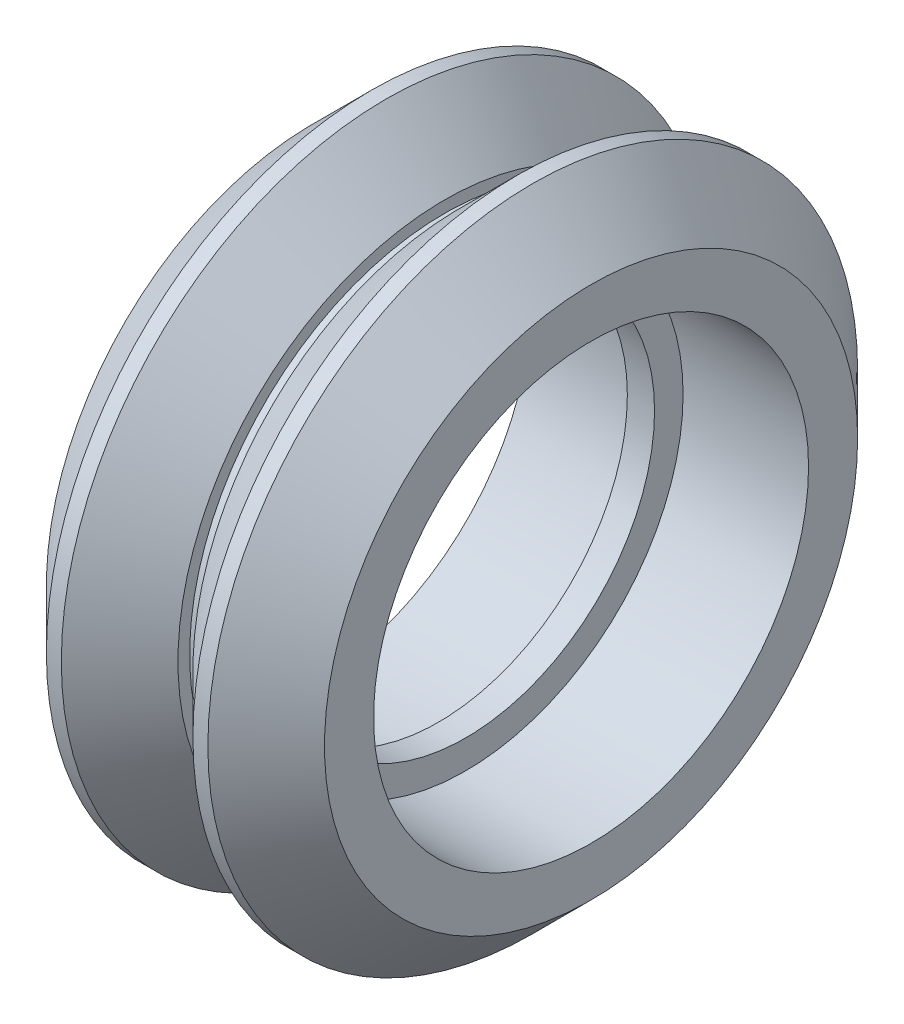
ISO-10303-21;
HEADER;
FILE_DESCRIPTION(('STEP AP214'),'2;1');
FILE_NAME('part.step','',(''),(''),'','','');
FILE_SCHEMA(('AUTOMOTIVE_DESIGN { 1 0 10303 214 1 1 1 1 }'));
ENDSEC;
DATA;
#1=APPLICATION_CONTEXT('core data for automotive mechanical design processes');
#2=APPLICATION_PROTOCOL_DEFINITION('international standard','automotive_design',2000,#1);
#3=PRODUCT_CONTEXT('',#1,'mechanical');
#4=PRODUCT('Part','Part','',(#3));
#5=PRODUCT_RELATED_PRODUCT_CATEGORY('part','',(#4));
#6=PRODUCT_DEFINITION_FORMATION('','',#4);
#7=PRODUCT_DEFINITION_CONTEXT('part definition',#1,'design');
#8=PRODUCT_DEFINITION('design','',#6,#7);
#9=PRODUCT_DEFINITION_SHAPE('','',#8);
#10=(LENGTH_UNIT() NAMED_UNIT(*) SI_UNIT(.MILLI.,.METRE.));
#11=(NAMED_UNIT(*) PLANE_ANGLE_UNIT() SI_UNIT($,.RADIAN.));
#12=(NAMED_UNIT(*) SI_UNIT($,.STERADIAN.) SOLID_ANGLE_UNIT());
#13=UNCERTAINTY_MEASURE_WITH_UNIT(LENGTH_MEASURE(1.E-05),#10,'distance_accuracy_value','');
#14=(GEOMETRIC_REPRESENTATION_CONTEXT(3) GLOBAL_UNCERTAINTY_ASSIGNED_CONTEXT((#13)) GLOBAL_UNIT_ASSIGNED_CONTEXT((#10,
#11,#12)) REPRESENTATION_CONTEXT('',''));
#15=CARTESIAN_POINT('',(0.,0.,0.));
#16=DIRECTION('',(0.,0.,1.));
#17=DIRECTION('',(1.,0.,0.));
#18=AXIS2_PLACEMENT_3D('',#15,#16,#17);
#19=CARTESIAN_POINT('',(-0.499999999999999,6.95,0.));
#20=DIRECTION('',(-1.,0.,0.));
#21=DIRECTION('',(0.,0.,1.));
#22=AXIS2_PLACEMENT_3D('',#19,#20,#21);
#23=PLANE('',#22);
#24=CARTESIAN_POINT('',(-0.499999999999999,0.,0.));
#25=DIRECTION('',(1.,0.,0.));
#26=DIRECTION('',(0.,0.,-1.));
#27=AXIS2_PLACEMENT_3D('',#24,#25,#26);
#28=CIRCLE('',#27,6.95);
#29=CARTESIAN_POINT('',(-0.499999999999999,0.,-6.95));
#30=VERTEX_POINT('',#29);
#31=EDGE_CURVE('E10',#30,#30,#28,.T.);
#32=ORIENTED_EDGE('',*,*,#31,.T.);
#33=EDGE_LOOP('',(#32));
#34=FACE_BOUND('',#33,.T.);
#35=CARTESIAN_POINT('',(-0.499999999999999,0.,0.));
#36=DIRECTION('',(1.,0.,0.));
#37=DIRECTION('',(0.,0.,-1.));
#38=AXIS2_PLACEMENT_3D('',#35,#36,#37);
#39=CIRCLE('',#38,8.);
#40=CARTESIAN_POINT('',(-0.499999999999999,0.,-8.));
#41=VERTEX_POINT('',#40);
#42=EDGE_CURVE('E85',#41,#41,#39,.T.);
#43=ORIENTED_EDGE('',*,*,#42,.F.);
#44=EDGE_LOOP('',(#43));
#45=FACE_BOUND('',#44,.T.);
#46=ADVANCED_FACE('F33',(#34,#45),#23,.T.);
#47=CARTESIAN_POINT('',(0.,0.,0.));
#48=DIRECTION('',(1.,0.,0.));
#49=DIRECTION('',(0.,0.,-1.));
#50=AXIS2_PLACEMENT_3D('',#47,#48,#49);
#51=CYLINDRICAL_SURFACE('',#50,6.95);
#52=CARTESIAN_POINT('',(0.500000000000001,0.,0.));
#53=DIRECTION('',(1.,0.,0.));
#54=DIRECTION('',(0.,0.,-1.));
#55=AXIS2_PLACEMENT_3D('',#52,#53,#54);
#56=CIRCLE('',#55,6.95);
#57=CARTESIAN_POINT('',(0.500000000000001,0.,-6.95));
#58=VERTEX_POINT('',#57);
#59=EDGE_CURVE('E39',#58,#58,#56,.T.);
#60=ORIENTED_EDGE('',*,*,#59,.T.);
#61=EDGE_LOOP('',(#60));
#62=FACE_BOUND('',#61,.T.);
#63=ORIENTED_EDGE('',*,*,#31,.F.);
#64=EDGE_LOOP('',(#63));
#65=FACE_BOUND('',#64,.T.);
#66=ADVANCED_FACE('F93',(#62,#65),#51,.F.);
#67=CARTESIAN_POINT('',(0.500000000000001,6.95,0.));
#68=DIRECTION('',(1.,0.,0.));
#69=DIRECTION('',(0.,0.,-1.));
#70=AXIS2_PLACEMENT_3D('',#67,#68,#69);
#71=PLANE('',#70);
#72=CARTESIAN_POINT('',(0.5,0.,0.));
#73=DIRECTION('',(1.,0.,0.));
#74=DIRECTION('',(0.,0.,-1.));
#75=AXIS2_PLACEMENT_3D('',#72,#73,#74);
#76=CIRCLE('',#75,8.);
#77=CARTESIAN_POINT('',(0.5,0.,-8.));
#78=VERTEX_POINT('',#77);
#79=EDGE_CURVE('E43',#78,#78,#76,.T.);
#80=ORIENTED_EDGE('',*,*,#79,.T.);
#81=EDGE_LOOP('',(#80));
#82=FACE_BOUND('',#81,.T.);
#83=ORIENTED_EDGE('',*,*,#59,.F.);
#84=EDGE_LOOP('',(#83));
#85=FACE_BOUND('',#84,.T.);
#86=ADVANCED_FACE('F97',(#82,#85),#71,.T.);
#87=CARTESIAN_POINT('',(0.,0.,0.));
#88=DIRECTION('',(1.,0.,0.));
#89=DIRECTION('',(0.,0.,-1.));
#90=AXIS2_PLACEMENT_3D('',#87,#88,#89);
#91=CYLINDRICAL_SURFACE('',#90,8.);
#92=CARTESIAN_POINT('',(5.115,0.,0.));
#93=DIRECTION('',(1.,0.,0.));
#94=DIRECTION('',(0.,0.,-1.));
#95=AXIS2_PLACEMENT_3D('',#92,#93,#94);
#96=CIRCLE('',#95,8.);
#97=CARTESIAN_POINT('',(5.115,0.,-8.));
#98=VERTEX_POINT('',#97);
#99=EDGE_CURVE('E47',#98,#98,#96,.T.);
#100=ORIENTED_EDGE('',*,*,#99,.T.);
#101=EDGE_LOOP('',(#100));
#102=FACE_BOUND('',#101,.T.);
#103=ORIENTED_EDGE('',*,*,#79,.F.);
#104=EDGE_LOOP('',(#103));
#105=FACE_BOUND('',#104,.T.);
#106=ADVANCED_FACE('F101',(#102,#105),#91,.F.);
#107=CARTESIAN_POINT('',(5.115,8.,0.));
#108=DIRECTION('',(1.,0.,0.));
#109=DIRECTION('',(0.,0.,-1.));
#110=AXIS2_PLACEMENT_3D('',#107,#108,#109);
#111=PLANE('',#110);
#112=CARTESIAN_POINT('',(5.115,0.,0.));
#113=DIRECTION('',(1.,0.,0.));
#114=DIRECTION('',(0.,0.,-1.));
#115=AXIS2_PLACEMENT_3D('',#112,#113,#114);
#116=CIRCLE('',#115,9.805);
#117=CARTESIAN_POINT('',(5.115,0.,-9.805));
#118=VERTEX_POINT('',#117);
#119=EDGE_CURVE('E52',#118,#118,#116,.T.);
#120=ORIENTED_EDGE('',*,*,#119,.T.);
#121=EDGE_LOOP('',(#120));
#122=FACE_BOUND('',#121,.T.);
#123=ORIENTED_EDGE('',*,*,#99,.F.);
#124=EDGE_LOOP('',(#123));
#125=FACE_BOUND('',#124,.T.);
#126=ADVANCED_FACE('F108',(#122,#125),#111,.T.);
#127=CARTESIAN_POINT('',(5.115,0.,0.));
#128=DIRECTION('',(-1.,0.,0.));
#129=DIRECTION('',(0.,0.,1.));
#130=AXIS2_PLACEMENT_3D('',#127,#128,#129);
#131=CONICAL_SURFACE('',#130,9.805,0.785398163397447);
#132=CARTESIAN_POINT('',(2.96999999999999,0.,0.));
#133=DIRECTION('',(1.,0.,0.));
#134=DIRECTION('',(0.,0.,-1.));
#135=AXIS2_PLACEMENT_3D('',#132,#133,#134);
#136=CIRCLE('',#135,11.95);
#137=CARTESIAN_POINT('',(2.96999999999999,0.,-11.95));
#138=VERTEX_POINT('',#137);
#139=EDGE_CURVE('E55',#138,#138,#136,.T.);
#140=ORIENTED_EDGE('',*,*,#139,.T.);
#141=EDGE_LOOP('',(#140));
#142=FACE_BOUND('',#141,.T.);
#143=ORIENTED_EDGE('',*,*,#119,.F.);
#144=EDGE_LOOP('',(#143));
#145=FACE_BOUND('',#144,.T.);
#146=ADVANCED_FACE('F112',(#142,#145),#131,.T.);
#147=CARTESIAN_POINT('',(0.,0.,0.));
#148=DIRECTION('',(1.,0.,0.));
#149=DIRECTION('',(0.,0.,-1.));
#150=AXIS2_PLACEMENT_3D('',#147,#148,#149);
#151=CYLINDRICAL_SURFACE('',#150,11.95);
#152=CARTESIAN_POINT('',(2.41999999999999,0.,0.));
#153=DIRECTION('',(1.,0.,0.));
#154=DIRECTION('',(0.,0.,-1.));
#155=AXIS2_PLACEMENT_3D('',#152,#153,#154);
#156=CIRCLE('',#155,11.95);
#157=CARTESIAN_POINT('',(2.41999999999999,0.,-11.95));
#158=VERTEX_POINT('',#157);
#159=EDGE_CURVE('E58',#158,#158,#156,.T.);
#160=ORIENTED_EDGE('',*,*,#159,.T.);
#161=EDGE_LOOP('',(#160));
#162=FACE_BOUND('',#161,.T.);
#163=ORIENTED_EDGE('',*,*,#139,.F.);
#164=EDGE_LOOP('',(#163));
#165=FACE_BOUND('',#164,.T.);
#166=ADVANCED_FACE('F116',(#162,#165),#151,.T.);
#167=CARTESIAN_POINT('',(2.41999999999999,0.,0.));
#168=DIRECTION('',(1.,0.,0.));
#169=DIRECTION('',(0.,0.,-1.));
#170=AXIS2_PLACEMENT_3D('',#167,#168,#169);
#171=CONICAL_SURFACE('',#170,11.95,0.785398163397449);
#172=CARTESIAN_POINT('',(0.274999999999998,0.,0.));
#173=DIRECTION('',(1.,0.,0.));
#174=DIRECTION('',(0.,0.,-1.));
#175=AXIS2_PLACEMENT_3D('',#172,#173,#174);
#176=CIRCLE('',#175,9.805);
#177=CARTESIAN_POINT('',(0.274999999999998,0.,-9.805));
#178=VERTEX_POINT('',#177);
#179=EDGE_CURVE('E61',#178,#178,#176,.T.);
#180=ORIENTED_EDGE('',*,*,#179,.T.);
#181=EDGE_LOOP('',(#180));
#182=FACE_BOUND('',#181,.T.);
#183=ORIENTED_EDGE('',*,*,#159,.F.);
#184=EDGE_LOOP('',(#183));
#185=FACE_BOUND('',#184,.T.);
#186=ADVANCED_FACE('F120',(#182,#185),#171,.T.);
#187=CARTESIAN_POINT('',(0.275,9.805,0.));
#188=DIRECTION('',(-1.,0.,0.));
#189=DIRECTION('',(0.,0.,1.));
#190=AXIS2_PLACEMENT_3D('',#187,#188,#189);
#191=PLANE('',#190);
#192=CARTESIAN_POINT('',(0.275000000000003,0.,0.));
#193=DIRECTION('',(1.,0.,0.));
#194=DIRECTION('',(0.,0.,-1.));
#195=AXIS2_PLACEMENT_3D('',#192,#193,#194);
#196=CIRCLE('',#195,9.375);
#197=CARTESIAN_POINT('',(0.275000000000003,0.,-9.375));
#198=VERTEX_POINT('',#197);
#199=EDGE_CURVE('E64',#198,#198,#196,.T.);
#200=ORIENTED_EDGE('',*,*,#199,.T.);
#201=EDGE_LOOP('',(#200));
#202=FACE_BOUND('',#201,.T.);
#203=ORIENTED_EDGE('',*,*,#179,.F.);
#204=EDGE_LOOP('',(#203));
#205=FACE_BOUND('',#204,.T.);
#206=ADVANCED_FACE('F124',(#202,#205),#191,.T.);
#207=CARTESIAN_POINT('',(0.,0.,0.));
#208=DIRECTION('',(1.,0.,0.));
#209=DIRECTION('',(0.,0.,-1.));
#210=AXIS2_PLACEMENT_3D('',#207,#208,#209);
#211=CYLINDRICAL_SURFACE('',#210,9.375);
#212=CARTESIAN_POINT('',(-0.274999999999998,0.,0.));
#213=DIRECTION('',(1.,0.,0.));
#214=DIRECTION('',(0.,0.,-1.));
#215=AXIS2_PLACEMENT_3D('',#212,#213,#214);
#216=CIRCLE('',#215,9.375);
#217=CARTESIAN_POINT('',(-0.274999999999998,0.,-9.375));
#218=VERTEX_POINT('',#217);
#219=EDGE_CURVE('E67',#218,#218,#216,.T.);
#220=ORIENTED_EDGE('',*,*,#219,.T.);
#221=EDGE_LOOP('',(#220));
#222=FACE_BOUND('',#221,.T.);
#223=ORIENTED_EDGE('',*,*,#199,.F.);
#224=EDGE_LOOP('',(#223));
#225=FACE_BOUND('',#224,.T.);
#226=ADVANCED_FACE('F128',(#222,#225),#211,.T.);
#227=CARTESIAN_POINT('',(-0.274999999999998,9.805,0.));
#228=DIRECTION('',(1.,0.,0.));
#229=DIRECTION('',(0.,0.,-1.));
#230=AXIS2_PLACEMENT_3D('',#227,#228,#229);
#231=PLANE('',#230);
#232=CARTESIAN_POINT('',(-0.274999999999998,0.,0.));
#233=DIRECTION('',(1.,0.,0.));
#234=DIRECTION('',(0.,0.,-1.));
#235=AXIS2_PLACEMENT_3D('',#232,#233,#234);
#236=CIRCLE('',#235,9.805);
#237=CARTESIAN_POINT('',(-0.274999999999998,0.,-9.805));
#238=VERTEX_POINT('',#237);
#239=EDGE_CURVE('E70',#238,#238,#236,.T.);
#240=ORIENTED_EDGE('',*,*,#239,.T.);
#241=EDGE_LOOP('',(#240));
#242=FACE_BOUND('',#241,.T.);
#243=ORIENTED_EDGE('',*,*,#219,.F.);
#244=EDGE_LOOP('',(#243));
#245=FACE_BOUND('',#244,.T.);
#246=ADVANCED_FACE('F132',(#242,#245),#231,.T.);
#247=CARTESIAN_POINT('',(-0.274999999999998,0.,0.));
#248=DIRECTION('',(-1.,0.,0.));
#249=DIRECTION('',(0.,0.,1.));
#250=AXIS2_PLACEMENT_3D('',#247,#248,#249);
#251=CONICAL_SURFACE('',#250,9.805,0.785398163397449);
#252=CARTESIAN_POINT('',(-2.41999999999999,0.,0.));
#253=DIRECTION('',(1.,0.,0.));
#254=DIRECTION('',(0.,0.,-1.));
#255=AXIS2_PLACEMENT_3D('',#252,#253,#254);
#256=CIRCLE('',#255,11.95);
#257=CARTESIAN_POINT('',(-2.41999999999999,0.,-11.95));
#258=VERTEX_POINT('',#257);
#259=EDGE_CURVE('E73',#258,#258,#256,.T.);
#260=ORIENTED_EDGE('',*,*,#259,.T.);
#261=EDGE_LOOP('',(#260));
#262=FACE_BOUND('',#261,.T.);
#263=ORIENTED_EDGE('',*,*,#239,.F.);
#264=EDGE_LOOP('',(#263));
#265=FACE_BOUND('',#264,.T.);
#266=ADVANCED_FACE('F136',(#262,#265),#251,.T.);
#267=CARTESIAN_POINT('',(0.,0.,0.));
#268=DIRECTION('',(1.,0.,0.));
#269=DIRECTION('',(0.,0.,-1.));
#270=AXIS2_PLACEMENT_3D('',#267,#268,#269);
#271=CYLINDRICAL_SURFACE('',#270,11.95);
#272=CARTESIAN_POINT('',(-2.96999999999999,0.,0.));
#273=DIRECTION('',(1.,0.,0.));
#274=DIRECTION('',(0.,0.,-1.));
#275=AXIS2_PLACEMENT_3D('',#272,#273,#274);
#276=CIRCLE('',#275,11.95);
#277=CARTESIAN_POINT('',(-2.96999999999999,0.,-11.95));
#278=VERTEX_POINT('',#277);
#279=EDGE_CURVE('E76',#278,#278,#276,.T.);
#280=ORIENTED_EDGE('',*,*,#279,.T.);
#281=EDGE_LOOP('',(#280));
#282=FACE_BOUND('',#281,.T.);
#283=ORIENTED_EDGE('',*,*,#259,.F.);
#284=EDGE_LOOP('',(#283));
#285=FACE_BOUND('',#284,.T.);
#286=ADVANCED_FACE('F140',(#282,#285),#271,.T.);
#287=CARTESIAN_POINT('',(-2.96999999999999,0.,0.));
#288=DIRECTION('',(1.,0.,0.));
#289=DIRECTION('',(0.,0.,-1.));
#290=AXIS2_PLACEMENT_3D('',#287,#288,#289);
#291=CONICAL_SURFACE('',#290,11.95,0.785398163397447);
#292=CARTESIAN_POINT('',(-5.115,0.,0.));
#293=DIRECTION('',(1.,0.,0.));
#294=DIRECTION('',(0.,0.,-1.));
#295=AXIS2_PLACEMENT_3D('',#292,#293,#294);
#296=CIRCLE('',#295,9.805);
#297=CARTESIAN_POINT('',(-5.115,0.,-9.805));
#298=VERTEX_POINT('',#297);
#299=EDGE_CURVE('E79',#298,#298,#296,.T.);
#300=ORIENTED_EDGE('',*,*,#299,.T.);
#301=EDGE_LOOP('',(#300));
#302=FACE_BOUND('',#301,.T.);
#303=ORIENTED_EDGE('',*,*,#279,.F.);
#304=EDGE_LOOP('',(#303));
#305=FACE_BOUND('',#304,.T.);
#306=ADVANCED_FACE('F144',(#302,#305),#291,.T.);
#307=CARTESIAN_POINT('',(-5.115,8.,0.));
#308=DIRECTION('',(-1.,0.,0.));
#309=DIRECTION('',(0.,0.,1.));
#310=AXIS2_PLACEMENT_3D('',#307,#308,#309);
#311=PLANE('',#310);
#312=CARTESIAN_POINT('',(-5.115,0.,0.));
#313=DIRECTION('',(1.,0.,0.));
#314=DIRECTION('',(0.,0.,-1.));
#315=AXIS2_PLACEMENT_3D('',#312,#313,#314);
#316=CIRCLE('',#315,8.);
#317=CARTESIAN_POINT('',(-5.115,0.,-8.));
#318=VERTEX_POINT('',#317);
#319=EDGE_CURVE('E82',#318,#318,#316,.T.);
#320=ORIENTED_EDGE('',*,*,#319,.T.);
#321=EDGE_LOOP('',(#320));
#322=FACE_BOUND('',#321,.T.);
#323=ORIENTED_EDGE('',*,*,#299,.F.);
#324=EDGE_LOOP('',(#323));
#325=FACE_BOUND('',#324,.T.);
#326=ADVANCED_FACE('F148',(#322,#325),#311,.T.);
#327=CARTESIAN_POINT('',(0.,0.,0.));
#328=DIRECTION('',(1.,0.,0.));
#329=DIRECTION('',(0.,0.,-1.));
#330=AXIS2_PLACEMENT_3D('',#327,#328,#329);
#331=CYLINDRICAL_SURFACE('',#330,8.);
#332=ORIENTED_EDGE('',*,*,#42,.T.);
#333=EDGE_LOOP('',(#332));
#334=FACE_BOUND('',#333,.T.);
#335=ORIENTED_EDGE('',*,*,#319,.F.);
#336=EDGE_LOOP('',(#335));
#337=FACE_BOUND('',#336,.T.);
#338=ADVANCED_FACE('F89',(#334,#337),#331,.F.);
#339=CLOSED_SHELL('',(#46,#66,#86,#106,#126,#146,#166,#186,#206,#226,#246,#266,#286,#306,#326,#338));
#340=MANIFOLD_SOLID_BREP('B2',#339);
#341=ADVANCED_BREP_SHAPE_REPRESENTATION('',(#18,#340),#14);
#342=SHAPE_DEFINITION_REPRESENTATION(#9,#341);
ENDSEC;
END-ISO-10303-21;
